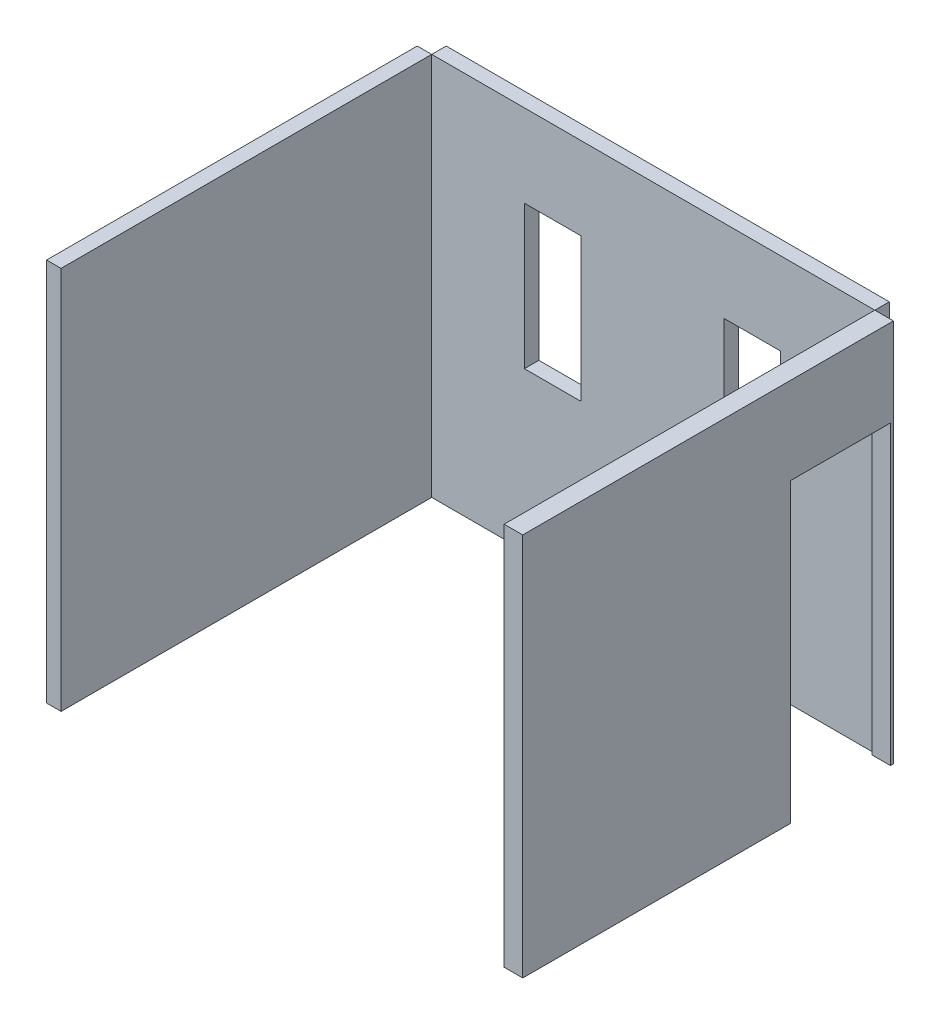
ISO-10303-21;
HEADER;
FILE_DESCRIPTION(('STEP AP214'),'2;1');
FILE_NAME('part.step','',(''),(''),'','','');
FILE_SCHEMA(('AUTOMOTIVE_DESIGN { 1 0 10303 214 1 1 1 1 }'));
ENDSEC;
DATA;
#1=APPLICATION_CONTEXT('core data for automotive mechanical design processes');
#2=APPLICATION_PROTOCOL_DEFINITION('international standard','automotive_design',2000,#1);
#3=PRODUCT_CONTEXT('',#1,'mechanical');
#4=PRODUCT('Part','Part','',(#3));
#5=PRODUCT_RELATED_PRODUCT_CATEGORY('part','',(#4));
#6=PRODUCT_DEFINITION_FORMATION('','',#4);
#7=PRODUCT_DEFINITION_CONTEXT('part definition',#1,'design');
#8=PRODUCT_DEFINITION('design','',#6,#7);
#9=PRODUCT_DEFINITION_SHAPE('','',#8);
#10=(LENGTH_UNIT() NAMED_UNIT(*) SI_UNIT(.MILLI.,.METRE.));
#11=(NAMED_UNIT(*) PLANE_ANGLE_UNIT() SI_UNIT($,.RADIAN.));
#12=(NAMED_UNIT(*) SI_UNIT($,.STERADIAN.) SOLID_ANGLE_UNIT());
#13=UNCERTAINTY_MEASURE_WITH_UNIT(LENGTH_MEASURE(1.E-05),#10,'distance_accuracy_value','');
#14=(GEOMETRIC_REPRESENTATION_CONTEXT(3) GLOBAL_UNCERTAINTY_ASSIGNED_CONTEXT((#13)) GLOBAL_UNIT_ASSIGNED_CONTEXT((#10,
#11,#12)) REPRESENTATION_CONTEXT('',''));
#15=CARTESIAN_POINT('',(0.,0.,0.));
#16=DIRECTION('',(0.,0.,1.));
#17=DIRECTION('',(1.,0.,0.));
#18=AXIS2_PLACEMENT_3D('',#15,#16,#17);
#19=CARTESIAN_POINT('',(3188.55153638041,0.,2660.));
#20=DIRECTION('',(0.,1.,0.));
#21=DIRECTION('',(0.,0.,1.));
#22=AXIS2_PLACEMENT_3D('',#19,#20,#21);
#23=PLANE('',#22);
#24=DIRECTION('',(0.,0.,-1.));
#25=VECTOR('',#24,1.);
#26=CARTESIAN_POINT('',(3060.,0.,2660.));
#27=LINE('',#26,#25);
#28=CARTESIAN_POINT('',(3060.,0.,2660.));
#29=VERTEX_POINT('',#28);
#30=CARTESIAN_POINT('',(3060.,0.,810.));
#31=VERTEX_POINT('',#30);
#32=EDGE_CURVE('E12',#29,#31,#27,.T.);
#33=ORIENTED_EDGE('',*,*,#32,.T.);
#34=DIRECTION('',(1.,0.,0.));
#35=VECTOR('',#34,1.);
#36=CARTESIAN_POINT('',(2138.55153638041,0.,810.));
#37=LINE('',#36,#35);
#38=CARTESIAN_POINT('',(3188.55153638041,0.,810.));
#39=VERTEX_POINT('',#38);
#40=EDGE_CURVE('E121',#31,#39,#37,.T.);
#41=ORIENTED_EDGE('',*,*,#40,.T.);
#42=DIRECTION('',(0.,0.,-1.));
#43=VECTOR('',#42,1.);
#44=CARTESIAN_POINT('',(3188.55153638041,0.,2660.));
#45=LINE('',#44,#43);
#46=CARTESIAN_POINT('',(3188.55153638041,0.,2660.));
#47=VERTEX_POINT('',#46);
#48=EDGE_CURVE('E131',#47,#39,#45,.T.);
#49=ORIENTED_EDGE('',*,*,#48,.F.);
#50=DIRECTION('',(1.,0.,0.));
#51=VECTOR('',#50,1.);
#52=CARTESIAN_POINT('',(3188.55153638041,0.,2660.));
#53=LINE('',#52,#51);
#54=EDGE_CURVE('E96',#29,#47,#53,.T.);
#55=ORIENTED_EDGE('',*,*,#54,.F.);
#56=EDGE_LOOP('',(#33,#41,#49,#55));
#57=FACE_BOUND('',#56,.T.);
#58=ADVANCED_FACE('F44',(#57),#23,.F.);
#59=CARTESIAN_POINT('',(3060.,2650.,2660.));
#60=DIRECTION('',(1.,0.,0.));
#61=DIRECTION('',(0.,0.,-1.));
#62=AXIS2_PLACEMENT_3D('',#59,#60,#61);
#63=PLANE('',#62);
#64=DIRECTION('',(0.,0.,1.));
#65=VECTOR('',#64,1.);
#66=CARTESIAN_POINT('',(3060.,2050.,2660.));
#67=LINE('',#66,#65);
#68=CARTESIAN_POINT('',(3060.,2050.,120.));
#69=VERTEX_POINT('',#68);
#70=CARTESIAN_POINT('',(3060.,2050.,810.));
#71=VERTEX_POINT('',#70);
#72=EDGE_CURVE('E161',#69,#71,#67,.T.);
#73=ORIENTED_EDGE('',*,*,#72,.T.);
#74=DIRECTION('',(0.,-1.,0.));
#75=VECTOR('',#74,1.);
#76=CARTESIAN_POINT('',(3060.,2650.,810.));
#77=LINE('',#76,#75);
#78=EDGE_CURVE('E155',#71,#31,#77,.T.);
#79=ORIENTED_EDGE('',*,*,#78,.T.);
#80=ORIENTED_EDGE('',*,*,#32,.F.);
#81=DIRECTION('',(0.,-1.,0.));
#82=VECTOR('',#81,1.);
#83=CARTESIAN_POINT('',(3060.,2650.,2660.));
#84=LINE('',#83,#82);
#85=CARTESIAN_POINT('',(3060.,2650.,2660.));
#86=VERTEX_POINT('',#85);
#87=EDGE_CURVE('E146',#86,#29,#84,.T.);
#88=ORIENTED_EDGE('',*,*,#87,.F.);
#89=DIRECTION('',(0.,0.,-1.));
#90=VECTOR('',#89,1.);
#91=CARTESIAN_POINT('',(3060.,2650.,2660.));
#92=LINE('',#91,#90);
#93=CARTESIAN_POINT('',(3060.,2650.,100.));
#94=VERTEX_POINT('',#93);
#95=EDGE_CURVE('E143',#86,#94,#92,.T.);
#96=ORIENTED_EDGE('',*,*,#95,.T.);
#97=DIRECTION('',(0.,-1.,0.));
#98=VECTOR('',#97,1.);
#99=CARTESIAN_POINT('',(3060.,2650.,100.));
#100=LINE('',#99,#98);
#101=CARTESIAN_POINT('',(3060.,0.,100.));
#102=VERTEX_POINT('',#101);
#103=EDGE_CURVE('E152',#94,#102,#100,.T.);
#104=ORIENTED_EDGE('',*,*,#103,.T.);
#105=CARTESIAN_POINT('',(3060.,0.,120.));
#106=VERTEX_POINT('',#105);
#107=EDGE_CURVE('E52',#106,#102,#27,.T.);
#108=ORIENTED_EDGE('',*,*,#107,.F.);
#109=DIRECTION('',(0.,1.,0.));
#110=VECTOR('',#109,1.);
#111=CARTESIAN_POINT('',(3060.,2650.,120.));
#112=LINE('',#111,#110);
#113=EDGE_CURVE('E164',#106,#69,#112,.T.);
#114=ORIENTED_EDGE('',*,*,#113,.T.);
#115=EDGE_LOOP('',(#73,#79,#80,#88,#96,#104,#108,#114));
#116=FACE_BOUND('',#115,.T.);
#117=ADVANCED_FACE('F46',(#116),#63,.F.);
#118=CARTESIAN_POINT('',(3188.55153638041,0.,120.));
#119=VERTEX_POINT('',#118);
#120=CARTESIAN_POINT('',(3188.55153638041,0.,100.));
#121=VERTEX_POINT('',#120);
#122=EDGE_CURVE('E139',#119,#121,#45,.T.);
#123=ORIENTED_EDGE('',*,*,#122,.F.);
#124=DIRECTION('',(1.,0.,0.));
#125=VECTOR('',#124,1.);
#126=CARTESIAN_POINT('',(2138.55153638041,0.,120.));
#127=LINE('',#126,#125);
#128=EDGE_CURVE('E59',#106,#119,#127,.T.);
#129=ORIENTED_EDGE('',*,*,#128,.F.);
#130=ORIENTED_EDGE('',*,*,#107,.T.);
#131=DIRECTION('',(1.,0.,0.));
#132=VECTOR('',#131,1.);
#133=CARTESIAN_POINT('',(3188.55153638041,0.,100.));
#134=LINE('',#133,#132);
#135=EDGE_CURVE('E149',#102,#121,#134,.T.);
#136=ORIENTED_EDGE('',*,*,#135,.T.);
#137=EDGE_LOOP('',(#123,#129,#130,#136));
#138=FACE_BOUND('',#137,.T.);
#139=ADVANCED_FACE('F180',(#138),#23,.F.);
#140=CARTESIAN_POINT('',(3188.55153638041,2650.,2660.));
#141=DIRECTION('',(-1.,0.,0.));
#142=DIRECTION('',(0.,0.,1.));
#143=AXIS2_PLACEMENT_3D('',#140,#141,#142);
#144=PLANE('',#143);
#145=ORIENTED_EDGE('',*,*,#48,.T.);
#146=DIRECTION('',(0.,-1.,0.));
#147=VECTOR('',#146,1.);
#148=CARTESIAN_POINT('',(3188.55153638041,2050.,810.));
#149=LINE('',#148,#147);
#150=CARTESIAN_POINT('',(3188.55153638041,2050.,810.));
#151=VERTEX_POINT('',#150);
#152=EDGE_CURVE('E118',#151,#39,#149,.T.);
#153=ORIENTED_EDGE('',*,*,#152,.F.);
#154=DIRECTION('',(0.,0.,1.));
#155=VECTOR('',#154,1.);
#156=CARTESIAN_POINT('',(3188.55153638041,2050.,810.));
#157=LINE('',#156,#155);
#158=CARTESIAN_POINT('',(3188.55153638041,2050.,120.));
#159=VERTEX_POINT('',#158);
#160=EDGE_CURVE('E134',#159,#151,#157,.T.);
#161=ORIENTED_EDGE('',*,*,#160,.F.);
#162=DIRECTION('',(0.,1.,0.));
#163=VECTOR('',#162,1.);
#164=CARTESIAN_POINT('',(3188.55153638041,0.,120.));
#165=LINE('',#164,#163);
#166=EDGE_CURVE('E129',#119,#159,#165,.T.);
#167=ORIENTED_EDGE('',*,*,#166,.F.);
#168=ORIENTED_EDGE('',*,*,#122,.T.);
#169=DIRECTION('',(0.,1.,0.));
#170=VECTOR('',#169,1.);
#171=CARTESIAN_POINT('',(3188.55153638041,2650.,100.));
#172=LINE('',#171,#170);
#173=CARTESIAN_POINT('',(3188.55153638041,2650.,100.));
#174=VERTEX_POINT('',#173);
#175=EDGE_CURVE('E147',#121,#174,#172,.T.);
#176=ORIENTED_EDGE('',*,*,#175,.T.);
#177=DIRECTION('',(0.,0.,-1.));
#178=VECTOR('',#177,1.);
#179=CARTESIAN_POINT('',(3188.55153638041,2650.,2660.));
#180=LINE('',#179,#178);
#181=CARTESIAN_POINT('',(3188.55153638041,2650.,2660.));
#182=VERTEX_POINT('',#181);
#183=EDGE_CURVE('E140',#182,#174,#180,.T.);
#184=ORIENTED_EDGE('',*,*,#183,.F.);
#185=DIRECTION('',(0.,1.,0.));
#186=VECTOR('',#185,1.);
#187=CARTESIAN_POINT('',(3188.55153638041,2650.,2660.));
#188=LINE('',#187,#186);
#189=EDGE_CURVE('E138',#47,#182,#188,.T.);
#190=ORIENTED_EDGE('',*,*,#189,.F.);
#191=EDGE_LOOP('',(#145,#153,#161,#167,#168,#176,#184,#190));
#192=FACE_BOUND('',#191,.T.);
#193=ADVANCED_FACE('F136',(#192),#144,.F.);
#194=CARTESIAN_POINT('',(3060.,2650.,2660.));
#195=DIRECTION('',(0.,-1.,0.));
#196=DIRECTION('',(0.,0.,-1.));
#197=AXIS2_PLACEMENT_3D('',#194,#195,#196);
#198=PLANE('',#197);
#199=DIRECTION('',(-1.,0.,0.));
#200=VECTOR('',#199,1.);
#201=CARTESIAN_POINT('',(3060.,2650.,100.));
#202=LINE('',#201,#200);
#203=EDGE_CURVE('E89',#174,#94,#202,.T.);
#204=ORIENTED_EDGE('',*,*,#203,.T.);
#205=ORIENTED_EDGE('',*,*,#95,.F.);
#206=DIRECTION('',(-1.,0.,0.));
#207=VECTOR('',#206,1.);
#208=CARTESIAN_POINT('',(3060.,2650.,2660.));
#209=LINE('',#208,#207);
#210=EDGE_CURVE('E68',#182,#86,#209,.T.);
#211=ORIENTED_EDGE('',*,*,#210,.F.);
#212=ORIENTED_EDGE('',*,*,#183,.T.);
#213=EDGE_LOOP('',(#204,#205,#211,#212));
#214=FACE_BOUND('',#213,.T.);
#215=ADVANCED_FACE('F184',(#214),#198,.F.);
#216=CARTESIAN_POINT('',(0.,0.,2660.));
#217=DIRECTION('',(0.,0.,-1.));
#218=DIRECTION('',(-1.,0.,0.));
#219=AXIS2_PLACEMENT_3D('',#216,#217,#218);
#220=PLANE('',#219);
#221=ORIENTED_EDGE('',*,*,#87,.T.);
#222=ORIENTED_EDGE('',*,*,#54,.T.);
#223=ORIENTED_EDGE('',*,*,#189,.T.);
#224=ORIENTED_EDGE('',*,*,#210,.T.);
#225=EDGE_LOOP('',(#221,#222,#223,#224));
#226=FACE_BOUND('',#225,.T.);
#227=ADVANCED_FACE('F188',(#226),#220,.F.);
#228=CARTESIAN_POINT('',(0.,0.,100.));
#229=DIRECTION('',(0.,0.,-1.));
#230=DIRECTION('',(-1.,0.,0.));
#231=AXIS2_PLACEMENT_3D('',#228,#229,#230);
#232=PLANE('',#231);
#233=ORIENTED_EDGE('',*,*,#103,.F.);
#234=ORIENTED_EDGE('',*,*,#203,.F.);
#235=ORIENTED_EDGE('',*,*,#175,.F.);
#236=ORIENTED_EDGE('',*,*,#135,.F.);
#237=EDGE_LOOP('',(#233,#234,#235,#236));
#238=FACE_BOUND('',#237,.T.);
#239=ADVANCED_FACE('F186',(#238),#232,.T.);
#240=CARTESIAN_POINT('',(2138.55153638041,2050.,810.));
#241=DIRECTION('',(0.,0.,1.));
#242=DIRECTION('',(0.,-1.,0.));
#243=AXIS2_PLACEMENT_3D('',#240,#241,#242);
#244=PLANE('',#243);
#245=DIRECTION('',(1.,0.,0.));
#246=VECTOR('',#245,1.);
#247=CARTESIAN_POINT('',(2138.55153638041,2050.,810.));
#248=LINE('',#247,#246);
#249=EDGE_CURVE('E124',#71,#151,#248,.T.);
#250=ORIENTED_EDGE('',*,*,#249,.T.);
#251=ORIENTED_EDGE('',*,*,#152,.T.);
#252=ORIENTED_EDGE('',*,*,#40,.F.);
#253=ORIENTED_EDGE('',*,*,#78,.F.);
#254=EDGE_LOOP('',(#250,#251,#252,#253));
#255=FACE_BOUND('',#254,.T.);
#256=ADVANCED_FACE('F120',(#255),#244,.F.);
#257=CARTESIAN_POINT('',(2138.55153638041,2050.,810.));
#258=DIRECTION('',(0.,1.,0.));
#259=DIRECTION('',(0.,0.,1.));
#260=AXIS2_PLACEMENT_3D('',#257,#258,#259);
#261=PLANE('',#260);
#262=DIRECTION('',(1.,0.,0.));
#263=VECTOR('',#262,1.);
#264=CARTESIAN_POINT('',(2138.55153638041,2050.,120.));
#265=LINE('',#264,#263);
#266=EDGE_CURVE('E168',#69,#159,#265,.T.);
#267=ORIENTED_EDGE('',*,*,#266,.T.);
#268=ORIENTED_EDGE('',*,*,#160,.T.);
#269=ORIENTED_EDGE('',*,*,#249,.F.);
#270=ORIENTED_EDGE('',*,*,#72,.F.);
#271=EDGE_LOOP('',(#267,#268,#269,#270));
#272=FACE_BOUND('',#271,.T.);
#273=ADVANCED_FACE('F176',(#272),#261,.F.);
#274=CARTESIAN_POINT('',(2138.55153638041,0.,120.));
#275=DIRECTION('',(0.,0.,-1.));
#276=DIRECTION('',(-1.,0.,0.));
#277=AXIS2_PLACEMENT_3D('',#274,#275,#276);
#278=PLANE('',#277);
#279=ORIENTED_EDGE('',*,*,#128,.T.);
#280=ORIENTED_EDGE('',*,*,#166,.T.);
#281=ORIENTED_EDGE('',*,*,#266,.F.);
#282=ORIENTED_EDGE('',*,*,#113,.F.);
#283=EDGE_LOOP('',(#279,#280,#281,#282));
#284=FACE_BOUND('',#283,.T.);
#285=ADVANCED_FACE('F173',(#284),#278,.F.);
#286=CLOSED_SHELL('',(#58,#117,#139,#193,#215,#227,#239,#256,#273,#285));
#287=MANIFOLD_SOLID_BREP('B2',#286);
#288=CARTESIAN_POINT('',(0.,2650.,2660.));
#289=DIRECTION('',(-1.,0.,0.));
#290=DIRECTION('',(0.,0.,1.));
#291=AXIS2_PLACEMENT_3D('',#288,#289,#290);
#292=PLANE('',#291);
#293=DIRECTION('',(0.,1.,0.));
#294=VECTOR('',#293,1.);
#295=CARTESIAN_POINT('',(0.,2650.,100.));
#296=LINE('',#295,#294);
#297=CARTESIAN_POINT('',(0.,0.,100.));
#298=VERTEX_POINT('',#297);
#299=CARTESIAN_POINT('',(0.,2650.,100.));
#300=VERTEX_POINT('',#299);
#301=EDGE_CURVE('E341',#298,#300,#296,.T.);
#302=ORIENTED_EDGE('',*,*,#301,.T.);
#303=DIRECTION('',(0.,0.,-1.));
#304=VECTOR('',#303,1.);
#305=CARTESIAN_POINT('',(0.,2650.,2660.));
#306=LINE('',#305,#304);
#307=CARTESIAN_POINT('',(0.,2650.,2660.));
#308=VERTEX_POINT('',#307);
#309=EDGE_CURVE('E42',#308,#300,#306,.T.);
#310=ORIENTED_EDGE('',*,*,#309,.F.);
#311=DIRECTION('',(0.,1.,0.));
#312=VECTOR('',#311,1.);
#313=CARTESIAN_POINT('',(0.,2650.,2660.));
#314=LINE('',#313,#312);
#315=CARTESIAN_POINT('',(0.,0.,2660.));
#316=VERTEX_POINT('',#315);
#317=EDGE_CURVE('E329',#316,#308,#314,.T.);
#318=ORIENTED_EDGE('',*,*,#317,.F.);
#319=DIRECTION('',(0.,0.,-1.));
#320=VECTOR('',#319,1.);
#321=CARTESIAN_POINT('',(0.,0.,2660.));
#322=LINE('',#321,#320);
#323=EDGE_CURVE('E337',#316,#298,#322,.T.);
#324=ORIENTED_EDGE('',*,*,#323,.T.);
#325=EDGE_LOOP('',(#302,#310,#318,#324));
#326=FACE_BOUND('',#325,.T.);
#327=ADVANCED_FACE('F278',(#326),#292,.F.);
#328=CARTESIAN_POINT('',(0.,2650.,2660.));
#329=DIRECTION('',(0.,-1.,0.));
#330=DIRECTION('',(0.,0.,-1.));
#331=AXIS2_PLACEMENT_3D('',#328,#329,#330);
#332=PLANE('',#331);
#333=DIRECTION('',(-1.,0.,0.));
#334=VECTOR('',#333,1.);
#335=CARTESIAN_POINT('',(0.,2650.,100.));
#336=LINE('',#335,#334);
#337=CARTESIAN_POINT('',(-100.,2650.,100.));
#338=VERTEX_POINT('',#337);
#339=EDGE_CURVE('E333',#300,#338,#336,.T.);
#340=ORIENTED_EDGE('',*,*,#339,.T.);
#341=DIRECTION('',(0.,0.,-1.));
#342=VECTOR('',#341,1.);
#343=CARTESIAN_POINT('',(-100.,2650.,2660.));
#344=LINE('',#343,#342);
#345=CARTESIAN_POINT('',(-100.,2650.,2660.));
#346=VERTEX_POINT('',#345);
#347=EDGE_CURVE('E286',#346,#338,#344,.T.);
#348=ORIENTED_EDGE('',*,*,#347,.F.);
#349=DIRECTION('',(-1.,0.,0.));
#350=VECTOR('',#349,1.);
#351=CARTESIAN_POINT('',(0.,2650.,2660.));
#352=LINE('',#351,#350);
#353=EDGE_CURVE('E324',#308,#346,#352,.T.);
#354=ORIENTED_EDGE('',*,*,#353,.F.);
#355=ORIENTED_EDGE('',*,*,#309,.T.);
#356=EDGE_LOOP('',(#340,#348,#354,#355));
#357=FACE_BOUND('',#356,.T.);
#358=ADVANCED_FACE('F332',(#357),#332,.F.);
#359=CARTESIAN_POINT('',(-100.,2650.,2660.));
#360=DIRECTION('',(1.,0.,0.));
#361=DIRECTION('',(0.,1.,0.));
#362=AXIS2_PLACEMENT_3D('',#359,#360,#361);
#363=PLANE('',#362);
#364=DIRECTION('',(0.,-1.,0.));
#365=VECTOR('',#364,1.);
#366=CARTESIAN_POINT('',(-100.,2650.,100.));
#367=LINE('',#366,#365);
#368=CARTESIAN_POINT('',(-99.9999999999997,0.,100.));
#369=VERTEX_POINT('',#368);
#370=EDGE_CURVE('E311',#338,#369,#367,.T.);
#371=ORIENTED_EDGE('',*,*,#370,.T.);
#372=DIRECTION('',(0.,0.,-1.));
#373=VECTOR('',#372,1.);
#374=CARTESIAN_POINT('',(-99.9999999999997,0.,2660.));
#375=LINE('',#374,#373);
#376=CARTESIAN_POINT('',(-99.9999999999997,0.,2660.));
#377=VERTEX_POINT('',#376);
#378=EDGE_CURVE('E334',#377,#369,#375,.T.);
#379=ORIENTED_EDGE('',*,*,#378,.F.);
#380=DIRECTION('',(0.,-1.,0.));
#381=VECTOR('',#380,1.);
#382=CARTESIAN_POINT('',(-100.,2650.,2660.));
#383=LINE('',#382,#381);
#384=EDGE_CURVE('E327',#346,#377,#383,.T.);
#385=ORIENTED_EDGE('',*,*,#384,.F.);
#386=ORIENTED_EDGE('',*,*,#347,.T.);
#387=EDGE_LOOP('',(#371,#379,#385,#386));
#388=FACE_BOUND('',#387,.T.);
#389=ADVANCED_FACE('F335',(#388),#363,.F.);
#390=CARTESIAN_POINT('',(0.,0.,2660.));
#391=DIRECTION('',(0.,1.,0.));
#392=DIRECTION('',(-1.,0.,0.));
#393=AXIS2_PLACEMENT_3D('',#390,#391,#392);
#394=PLANE('',#393);
#395=DIRECTION('',(1.,0.,0.));
#396=VECTOR('',#395,1.);
#397=CARTESIAN_POINT('',(0.,0.,100.));
#398=LINE('',#397,#396);
#399=EDGE_CURVE('E317',#369,#298,#398,.T.);
#400=ORIENTED_EDGE('',*,*,#399,.T.);
#401=ORIENTED_EDGE('',*,*,#323,.F.);
#402=DIRECTION('',(1.,0.,0.));
#403=VECTOR('',#402,1.);
#404=CARTESIAN_POINT('',(0.,0.,2660.));
#405=LINE('',#404,#403);
#406=EDGE_CURVE('E294',#377,#316,#405,.T.);
#407=ORIENTED_EDGE('',*,*,#406,.F.);
#408=ORIENTED_EDGE('',*,*,#378,.T.);
#409=EDGE_LOOP('',(#400,#401,#407,#408));
#410=FACE_BOUND('',#409,.T.);
#411=ADVANCED_FACE('F348',(#410),#394,.F.);
#412=CARTESIAN_POINT('',(0.,0.,2660.));
#413=DIRECTION('',(0.,0.,-1.));
#414=DIRECTION('',(-1.,0.,0.));
#415=AXIS2_PLACEMENT_3D('',#412,#413,#414);
#416=PLANE('',#415);
#417=ORIENTED_EDGE('',*,*,#317,.T.);
#418=ORIENTED_EDGE('',*,*,#353,.T.);
#419=ORIENTED_EDGE('',*,*,#384,.T.);
#420=ORIENTED_EDGE('',*,*,#406,.T.);
#421=EDGE_LOOP('',(#417,#418,#419,#420));
#422=FACE_BOUND('',#421,.T.);
#423=ADVANCED_FACE('F325',(#422),#416,.F.);
#424=CARTESIAN_POINT('',(0.,0.,100.));
#425=DIRECTION('',(0.,0.,-1.));
#426=DIRECTION('',(-1.,0.,0.));
#427=AXIS2_PLACEMENT_3D('',#424,#425,#426);
#428=PLANE('',#427);
#429=ORIENTED_EDGE('',*,*,#301,.F.);
#430=ORIENTED_EDGE('',*,*,#399,.F.);
#431=ORIENTED_EDGE('',*,*,#370,.F.);
#432=ORIENTED_EDGE('',*,*,#339,.F.);
#433=EDGE_LOOP('',(#429,#430,#431,#432));
#434=FACE_BOUND('',#433,.T.);
#435=ADVANCED_FACE('F351',(#434),#428,.T.);
#436=CLOSED_SHELL('',(#327,#358,#389,#411,#423,#435));
#437=MANIFOLD_SOLID_BREP('B6',#436);
#438=CARTESIAN_POINT('',(0.,0.,100.));
#439=DIRECTION('',(1.,0.,0.));
#440=DIRECTION('',(0.,0.,-1.));
#441=AXIS2_PLACEMENT_3D('',#438,#439,#440);
#442=PLANE('',#441);
#443=DIRECTION('',(0.,-1.,0.));
#444=VECTOR('',#443,1.);
#445=CARTESIAN_POINT('',(0.,0.,0.));
#446=LINE('',#445,#444);
#447=CARTESIAN_POINT('',(0.,2650.,0.));
#448=VERTEX_POINT('',#447);
#449=CARTESIAN_POINT('',(0.,0.,0.));
#450=VERTEX_POINT('',#449);
#451=EDGE_CURVE('E531',#448,#450,#446,.T.);
#452=ORIENTED_EDGE('',*,*,#451,.T.);
#453=DIRECTION('',(0.,0.,-1.));
#454=VECTOR('',#453,1.);
#455=CARTESIAN_POINT('',(0.,0.,100.));
#456=LINE('',#455,#454);
#457=CARTESIAN_POINT('',(0.,0.,100.));
#458=VERTEX_POINT('',#457);
#459=EDGE_CURVE('E564',#458,#450,#456,.T.);
#460=ORIENTED_EDGE('',*,*,#459,.F.);
#461=DIRECTION('',(0.,-1.,0.));
#462=VECTOR('',#461,1.);
#463=CARTESIAN_POINT('',(0.,0.,100.));
#464=LINE('',#463,#462);
#465=CARTESIAN_POINT('',(0.,2650.,100.));
#466=VERTEX_POINT('',#465);
#467=EDGE_CURVE('E538',#466,#458,#464,.T.);
#468=ORIENTED_EDGE('',*,*,#467,.F.);
#469=DIRECTION('',(0.,0.,-1.));
#470=VECTOR('',#469,1.);
#471=CARTESIAN_POINT('',(0.,2650.,100.));
#472=LINE('',#471,#470);
#473=EDGE_CURVE('E548',#466,#448,#472,.T.);
#474=ORIENTED_EDGE('',*,*,#473,.T.);
#475=EDGE_LOOP('',(#452,#460,#468,#474));
#476=FACE_BOUND('',#475,.T.);
#477=ADVANCED_FACE('F402',(#476),#442,.F.);
#478=CARTESIAN_POINT('',(0.,0.,100.));
#479=DIRECTION('',(0.,1.,0.));
#480=DIRECTION('',(0.,0.,1.));
#481=AXIS2_PLACEMENT_3D('',#478,#479,#480);
#482=PLANE('',#481);
#483=DIRECTION('',(1.,0.,0.));
#484=VECTOR('',#483,1.);
#485=CARTESIAN_POINT('',(0.,0.,0.));
#486=LINE('',#485,#484);
#487=CARTESIAN_POINT('',(3060.,0.,0.));
#488=VERTEX_POINT('',#487);
#489=EDGE_CURVE('E551',#450,#488,#486,.T.);
#490=ORIENTED_EDGE('',*,*,#489,.T.);
#491=DIRECTION('',(0.,0.,-1.));
#492=VECTOR('',#491,1.);
#493=CARTESIAN_POINT('',(3060.,0.,100.));
#494=LINE('',#493,#492);
#495=CARTESIAN_POINT('',(3060.,0.,100.));
#496=VERTEX_POINT('',#495);
#497=EDGE_CURVE('E561',#496,#488,#494,.T.);
#498=ORIENTED_EDGE('',*,*,#497,.F.);
#499=DIRECTION('',(1.,0.,0.));
#500=VECTOR('',#499,1.);
#501=CARTESIAN_POINT('',(0.,0.,100.));
#502=LINE('',#501,#500);
#503=EDGE_CURVE('E541',#458,#496,#502,.T.);
#504=ORIENTED_EDGE('',*,*,#503,.F.);
#505=ORIENTED_EDGE('',*,*,#459,.T.);
#506=EDGE_LOOP('',(#490,#498,#504,#505));
#507=FACE_BOUND('',#506,.T.);
#508=ADVANCED_FACE('F601',(#507),#482,.F.);
#509=CARTESIAN_POINT('',(3060.,0.,100.));
#510=DIRECTION('',(-1.,0.,0.));
#511=DIRECTION('',(0.,0.,1.));
#512=AXIS2_PLACEMENT_3D('',#509,#510,#511);
#513=PLANE('',#512);
#514=DIRECTION('',(0.,1.,0.));
#515=VECTOR('',#514,1.);
#516=CARTESIAN_POINT('',(3060.,0.,0.));
#517=LINE('',#516,#515);
#518=CARTESIAN_POINT('',(3060.,2650.,0.));
#519=VERTEX_POINT('',#518);
#520=EDGE_CURVE('E553',#488,#519,#517,.T.);
#521=ORIENTED_EDGE('',*,*,#520,.T.);
#522=DIRECTION('',(0.,0.,-1.));
#523=VECTOR('',#522,1.);
#524=CARTESIAN_POINT('',(3060.,2650.,100.));
#525=LINE('',#524,#523);
#526=CARTESIAN_POINT('',(3060.,2650.,100.));
#527=VERTEX_POINT('',#526);
#528=EDGE_CURVE('E558',#527,#519,#525,.T.);
#529=ORIENTED_EDGE('',*,*,#528,.F.);
#530=DIRECTION('',(0.,1.,0.));
#531=VECTOR('',#530,1.);
#532=CARTESIAN_POINT('',(3060.,0.,100.));
#533=LINE('',#532,#531);
#534=EDGE_CURVE('E544',#496,#527,#533,.T.);
#535=ORIENTED_EDGE('',*,*,#534,.F.);
#536=ORIENTED_EDGE('',*,*,#497,.T.);
#537=EDGE_LOOP('',(#521,#529,#535,#536));
#538=FACE_BOUND('',#537,.T.);
#539=ADVANCED_FACE('F606',(#538),#513,.F.);
#540=CARTESIAN_POINT('',(0.,2650.,100.));
#541=DIRECTION('',(0.,-1.,0.));
#542=DIRECTION('',(0.,0.,-1.));
#543=AXIS2_PLACEMENT_3D('',#540,#541,#542);
#544=PLANE('',#543);
#545=DIRECTION('',(-1.,0.,0.));
#546=VECTOR('',#545,1.);
#547=CARTESIAN_POINT('',(0.,2650.,0.));
#548=LINE('',#547,#546);
#549=EDGE_CURVE('E542',#519,#448,#548,.T.);
#550=ORIENTED_EDGE('',*,*,#549,.T.);
#551=ORIENTED_EDGE('',*,*,#473,.F.);
#552=DIRECTION('',(-1.,0.,0.));
#553=VECTOR('',#552,1.);
#554=CARTESIAN_POINT('',(0.,2650.,100.));
#555=LINE('',#554,#553);
#556=EDGE_CURVE('E546',#527,#466,#555,.T.);
#557=ORIENTED_EDGE('',*,*,#556,.F.);
#558=ORIENTED_EDGE('',*,*,#528,.T.);
#559=EDGE_LOOP('',(#550,#551,#557,#558));
#560=FACE_BOUND('',#559,.T.);
#561=ADVANCED_FACE('F621',(#560),#544,.F.);
#562=CARTESIAN_POINT('',(0.,0.,100.));
#563=DIRECTION('',(0.,0.,-1.));
#564=DIRECTION('',(-1.,0.,0.));
#565=AXIS2_PLACEMENT_3D('',#562,#563,#564);
#566=PLANE('',#565);
#567=DIRECTION('',(0.,-1.,0.));
#568=VECTOR('',#567,1.);
#569=CARTESIAN_POINT('',(640.,2080.,100.));
#570=LINE('',#569,#568);
#571=CARTESIAN_POINT('',(640.,2080.,100.));
#572=VERTEX_POINT('',#571);
#573=CARTESIAN_POINT('',(640.,1090.,100.));
#574=VERTEX_POINT('',#573);
#575=EDGE_CURVE('E501',#572,#574,#570,.T.);
#576=ORIENTED_EDGE('',*,*,#575,.F.);
#577=DIRECTION('',(-1.,0.,0.));
#578=VECTOR('',#577,1.);
#579=CARTESIAN_POINT('',(640.,2080.,100.));
#580=LINE('',#579,#578);
#581=CARTESIAN_POINT('',(1030.,2080.,100.));
#582=VERTEX_POINT('',#581);
#583=EDGE_CURVE('E416',#582,#572,#580,.T.);
#584=ORIENTED_EDGE('',*,*,#583,.F.);
#585=DIRECTION('',(0.,1.,0.));
#586=VECTOR('',#585,1.);
#587=CARTESIAN_POINT('',(1030.,2080.,100.));
#588=LINE('',#587,#586);
#589=CARTESIAN_POINT('',(1030.,1090.,100.));
#590=VERTEX_POINT('',#589);
#591=EDGE_CURVE('E508',#590,#582,#588,.T.);
#592=ORIENTED_EDGE('',*,*,#591,.F.);
#593=DIRECTION('',(1.,0.,0.));
#594=VECTOR('',#593,1.);
#595=CARTESIAN_POINT('',(1030.,1090.,100.));
#596=LINE('',#595,#594);
#597=EDGE_CURVE('E492',#574,#590,#596,.T.);
#598=ORIENTED_EDGE('',*,*,#597,.F.);
#599=EDGE_LOOP('',(#576,#584,#592,#598));
#600=FACE_BOUND('',#599,.T.);
#601=DIRECTION('',(0.,1.,0.));
#602=VECTOR('',#601,1.);
#603=CARTESIAN_POINT('',(2410.,1090.,100.));
#604=LINE('',#603,#602);
#605=CARTESIAN_POINT('',(2410.,1090.,100.));
#606=VERTEX_POINT('',#605);
#607=CARTESIAN_POINT('',(2410.,2080.,100.));
#608=VERTEX_POINT('',#607);
#609=EDGE_CURVE('E519',#606,#608,#604,.T.);
#610=ORIENTED_EDGE('',*,*,#609,.F.);
#611=DIRECTION('',(1.,0.,0.));
#612=VECTOR('',#611,1.);
#613=CARTESIAN_POINT('',(2020.,1090.,100.));
#614=LINE('',#613,#612);
#615=CARTESIAN_POINT('',(2020.,1090.,100.));
#616=VERTEX_POINT('',#615);
#617=EDGE_CURVE('E515',#616,#606,#614,.T.);
#618=ORIENTED_EDGE('',*,*,#617,.F.);
#619=DIRECTION('',(0.,-1.,0.));
#620=VECTOR('',#619,1.);
#621=CARTESIAN_POINT('',(2020.,2080.,100.));
#622=LINE('',#621,#620);
#623=CARTESIAN_POINT('',(2020.,2080.,100.));
#624=VERTEX_POINT('',#623);
#625=EDGE_CURVE('E525',#624,#616,#622,.T.);
#626=ORIENTED_EDGE('',*,*,#625,.F.);
#627=DIRECTION('',(-1.,0.,0.));
#628=VECTOR('',#627,1.);
#629=CARTESIAN_POINT('',(2410.,2080.,100.));
#630=LINE('',#629,#628);
#631=EDGE_CURVE('E522',#608,#624,#630,.T.);
#632=ORIENTED_EDGE('',*,*,#631,.F.);
#633=EDGE_LOOP('',(#610,#618,#626,#632));
#634=FACE_BOUND('',#633,.T.);
#635=ORIENTED_EDGE('',*,*,#467,.T.);
#636=ORIENTED_EDGE('',*,*,#503,.T.);
#637=ORIENTED_EDGE('',*,*,#534,.T.);
#638=ORIENTED_EDGE('',*,*,#556,.T.);
#639=EDGE_LOOP('',(#635,#636,#637,#638));
#640=FACE_BOUND('',#639,.T.);
#641=ADVANCED_FACE('F505',(#600,#634,#640),#566,.F.);
#642=CARTESIAN_POINT('',(0.,0.,0.));
#643=DIRECTION('',(0.,0.,-1.));
#644=DIRECTION('',(-1.,0.,0.));
#645=AXIS2_PLACEMENT_3D('',#642,#643,#644);
#646=PLANE('',#645);
#647=DIRECTION('',(1.,0.,0.));
#648=VECTOR('',#647,1.);
#649=CARTESIAN_POINT('',(0.,2080.,0.));
#650=LINE('',#649,#648);
#651=CARTESIAN_POINT('',(640.,2080.,0.));
#652=VERTEX_POINT('',#651);
#653=CARTESIAN_POINT('',(1030.,2080.,0.));
#654=VERTEX_POINT('',#653);
#655=EDGE_CURVE('E276',#652,#654,#650,.T.);
#656=ORIENTED_EDGE('',*,*,#655,.F.);
#657=DIRECTION('',(0.,1.,0.));
#658=VECTOR('',#657,1.);
#659=CARTESIAN_POINT('',(640.,0.,0.));
#660=LINE('',#659,#658);
#661=CARTESIAN_POINT('',(640.,1090.,0.));
#662=VERTEX_POINT('',#661);
#663=EDGE_CURVE('E576',#662,#652,#660,.T.);
#664=ORIENTED_EDGE('',*,*,#663,.F.);
#665=DIRECTION('',(-1.,0.,0.));
#666=VECTOR('',#665,1.);
#667=CARTESIAN_POINT('',(0.,1090.,0.));
#668=LINE('',#667,#666);
#669=CARTESIAN_POINT('',(1030.,1090.,0.));
#670=VERTEX_POINT('',#669);
#671=EDGE_CURVE('E495',#670,#662,#668,.T.);
#672=ORIENTED_EDGE('',*,*,#671,.F.);
#673=DIRECTION('',(0.,-1.,0.));
#674=VECTOR('',#673,1.);
#675=CARTESIAN_POINT('',(1030.,0.,0.));
#676=LINE('',#675,#674);
#677=EDGE_CURVE('E409',#654,#670,#676,.T.);
#678=ORIENTED_EDGE('',*,*,#677,.F.);
#679=EDGE_LOOP('',(#656,#664,#672,#678));
#680=FACE_BOUND('',#679,.T.);
#681=DIRECTION('',(-1.,0.,0.));
#682=VECTOR('',#681,1.);
#683=CARTESIAN_POINT('',(0.,1090.,0.));
#684=LINE('',#683,#682);
#685=CARTESIAN_POINT('',(2410.,1090.,0.));
#686=VERTEX_POINT('',#685);
#687=CARTESIAN_POINT('',(2020.,1090.,0.));
#688=VERTEX_POINT('',#687);
#689=EDGE_CURVE('E574',#686,#688,#684,.T.);
#690=ORIENTED_EDGE('',*,*,#689,.F.);
#691=DIRECTION('',(0.,-1.,0.));
#692=VECTOR('',#691,1.);
#693=CARTESIAN_POINT('',(2410.,0.,0.));
#694=LINE('',#693,#692);
#695=CARTESIAN_POINT('',(2410.,2080.,0.));
#696=VERTEX_POINT('',#695);
#697=EDGE_CURVE('E567',#696,#686,#694,.T.);
#698=ORIENTED_EDGE('',*,*,#697,.F.);
#699=DIRECTION('',(1.,0.,0.));
#700=VECTOR('',#699,1.);
#701=CARTESIAN_POINT('',(0.,2080.,0.));
#702=LINE('',#701,#700);
#703=CARTESIAN_POINT('',(2020.,2080.,0.));
#704=VERTEX_POINT('',#703);
#705=EDGE_CURVE('E569',#704,#696,#702,.T.);
#706=ORIENTED_EDGE('',*,*,#705,.F.);
#707=DIRECTION('',(0.,1.,0.));
#708=VECTOR('',#707,1.);
#709=CARTESIAN_POINT('',(2020.,0.,0.));
#710=LINE('',#709,#708);
#711=EDGE_CURVE('E572',#688,#704,#710,.T.);
#712=ORIENTED_EDGE('',*,*,#711,.F.);
#713=EDGE_LOOP('',(#690,#698,#706,#712));
#714=FACE_BOUND('',#713,.T.);
#715=ORIENTED_EDGE('',*,*,#451,.F.);
#716=ORIENTED_EDGE('',*,*,#549,.F.);
#717=ORIENTED_EDGE('',*,*,#520,.F.);
#718=ORIENTED_EDGE('',*,*,#489,.F.);
#719=EDGE_LOOP('',(#715,#716,#717,#718));
#720=FACE_BOUND('',#719,.T.);
#721=ADVANCED_FACE('F584',(#680,#714,#720),#646,.T.);
#722=CARTESIAN_POINT('',(2020.,1090.,-649.));
#723=DIRECTION('',(0.,-1.,0.));
#724=DIRECTION('',(0.,0.,-1.));
#725=AXIS2_PLACEMENT_3D('',#722,#723,#724);
#726=PLANE('',#725);
#727=ORIENTED_EDGE('',*,*,#689,.T.);
#728=DIRECTION('',(0.,0.,1.));
#729=VECTOR('',#728,1.);
#730=CARTESIAN_POINT('',(2020.,1090.,-649.));
#731=LINE('',#730,#729);
#732=EDGE_CURVE('E529',#688,#616,#731,.T.);
#733=ORIENTED_EDGE('',*,*,#732,.T.);
#734=ORIENTED_EDGE('',*,*,#617,.T.);
#735=DIRECTION('',(0.,0.,1.));
#736=VECTOR('',#735,1.);
#737=CARTESIAN_POINT('',(2410.,1090.,-649.));
#738=LINE('',#737,#736);
#739=EDGE_CURVE('E528',#686,#606,#738,.T.);
#740=ORIENTED_EDGE('',*,*,#739,.F.);
#741=EDGE_LOOP('',(#727,#733,#734,#740));
#742=FACE_BOUND('',#741,.T.);
#743=ADVANCED_FACE('F632',(#742),#726,.F.);
#744=CARTESIAN_POINT('',(2020.,2080.,-649.));
#745=DIRECTION('',(-1.,0.,0.));
#746=DIRECTION('',(0.,0.,1.));
#747=AXIS2_PLACEMENT_3D('',#744,#745,#746);
#748=PLANE('',#747);
#749=ORIENTED_EDGE('',*,*,#711,.T.);
#750=DIRECTION('',(0.,0.,1.));
#751=VECTOR('',#750,1.);
#752=CARTESIAN_POINT('',(2020.,2080.,-649.));
#753=LINE('',#752,#751);
#754=EDGE_CURVE('E532',#704,#624,#753,.T.);
#755=ORIENTED_EDGE('',*,*,#754,.T.);
#756=ORIENTED_EDGE('',*,*,#625,.T.);
#757=ORIENTED_EDGE('',*,*,#732,.F.);
#758=EDGE_LOOP('',(#749,#755,#756,#757));
#759=FACE_BOUND('',#758,.T.);
#760=ADVANCED_FACE('F636',(#759),#748,.F.);
#761=CARTESIAN_POINT('',(2410.,2080.,-649.));
#762=DIRECTION('',(0.,1.,0.));
#763=DIRECTION('',(0.,0.,1.));
#764=AXIS2_PLACEMENT_3D('',#761,#762,#763);
#765=PLANE('',#764);
#766=ORIENTED_EDGE('',*,*,#705,.T.);
#767=DIRECTION('',(0.,0.,1.));
#768=VECTOR('',#767,1.);
#769=CARTESIAN_POINT('',(2410.,2080.,-649.));
#770=LINE('',#769,#768);
#771=EDGE_CURVE('E534',#696,#608,#770,.T.);
#772=ORIENTED_EDGE('',*,*,#771,.T.);
#773=ORIENTED_EDGE('',*,*,#631,.T.);
#774=ORIENTED_EDGE('',*,*,#754,.F.);
#775=EDGE_LOOP('',(#766,#772,#773,#774));
#776=FACE_BOUND('',#775,.T.);
#777=ADVANCED_FACE('F595',(#776),#765,.F.);
#778=CARTESIAN_POINT('',(2410.,1090.,-649.));
#779=DIRECTION('',(1.,0.,0.));
#780=DIRECTION('',(0.,0.,-1.));
#781=AXIS2_PLACEMENT_3D('',#778,#779,#780);
#782=PLANE('',#781);
#783=ORIENTED_EDGE('',*,*,#697,.T.);
#784=ORIENTED_EDGE('',*,*,#739,.T.);
#785=ORIENTED_EDGE('',*,*,#609,.T.);
#786=ORIENTED_EDGE('',*,*,#771,.F.);
#787=EDGE_LOOP('',(#783,#784,#785,#786));
#788=FACE_BOUND('',#787,.T.);
#789=ADVANCED_FACE('F588',(#788),#782,.F.);
#790=CARTESIAN_POINT('',(640.,2080.,-649.));
#791=DIRECTION('',(0.,1.,0.));
#792=DIRECTION('',(0.,0.,1.));
#793=AXIS2_PLACEMENT_3D('',#790,#791,#792);
#794=PLANE('',#793);
#795=ORIENTED_EDGE('',*,*,#655,.T.);
#796=DIRECTION('',(0.,0.,1.));
#797=VECTOR('',#796,1.);
#798=CARTESIAN_POINT('',(1030.,2080.,-649.));
#799=LINE('',#798,#797);
#800=EDGE_CURVE('E513',#654,#582,#799,.T.);
#801=ORIENTED_EDGE('',*,*,#800,.T.);
#802=ORIENTED_EDGE('',*,*,#583,.T.);
#803=DIRECTION('',(0.,0.,1.));
#804=VECTOR('',#803,1.);
#805=CARTESIAN_POINT('',(640.,2080.,-649.));
#806=LINE('',#805,#804);
#807=EDGE_CURVE('E498',#652,#572,#806,.T.);
#808=ORIENTED_EDGE('',*,*,#807,.F.);
#809=EDGE_LOOP('',(#795,#801,#802,#808));
#810=FACE_BOUND('',#809,.T.);
#811=ADVANCED_FACE('F586',(#810),#794,.F.);
#812=CARTESIAN_POINT('',(1030.,2080.,-649.));
#813=DIRECTION('',(1.,0.,0.));
#814=DIRECTION('',(0.,0.,-1.));
#815=AXIS2_PLACEMENT_3D('',#812,#813,#814);
#816=PLANE('',#815);
#817=ORIENTED_EDGE('',*,*,#677,.T.);
#818=DIRECTION('',(0.,0.,1.));
#819=VECTOR('',#818,1.);
#820=CARTESIAN_POINT('',(1030.,1090.,-649.));
#821=LINE('',#820,#819);
#822=EDGE_CURVE('E497',#670,#590,#821,.T.);
#823=ORIENTED_EDGE('',*,*,#822,.T.);
#824=ORIENTED_EDGE('',*,*,#591,.T.);
#825=ORIENTED_EDGE('',*,*,#800,.F.);
#826=EDGE_LOOP('',(#817,#823,#824,#825));
#827=FACE_BOUND('',#826,.T.);
#828=ADVANCED_FACE('F581',(#827),#816,.F.);
#829=CARTESIAN_POINT('',(1030.,1090.,-649.));
#830=DIRECTION('',(0.,-1.,0.));
#831=DIRECTION('',(0.,0.,-1.));
#832=AXIS2_PLACEMENT_3D('',#829,#830,#831);
#833=PLANE('',#832);
#834=ORIENTED_EDGE('',*,*,#671,.T.);
#835=DIRECTION('',(0.,0.,1.));
#836=VECTOR('',#835,1.);
#837=CARTESIAN_POINT('',(640.,1090.,-649.));
#838=LINE('',#837,#836);
#839=EDGE_CURVE('E424',#662,#574,#838,.T.);
#840=ORIENTED_EDGE('',*,*,#839,.T.);
#841=ORIENTED_EDGE('',*,*,#597,.T.);
#842=ORIENTED_EDGE('',*,*,#822,.F.);
#843=EDGE_LOOP('',(#834,#840,#841,#842));
#844=FACE_BOUND('',#843,.T.);
#845=ADVANCED_FACE('F489',(#844),#833,.F.);
#846=CARTESIAN_POINT('',(640.,2080.,-649.));
#847=DIRECTION('',(-1.,0.,0.));
#848=DIRECTION('',(0.,-1.,0.));
#849=AXIS2_PLACEMENT_3D('',#846,#847,#848);
#850=PLANE('',#849);
#851=ORIENTED_EDGE('',*,*,#663,.T.);
#852=ORIENTED_EDGE('',*,*,#807,.T.);
#853=ORIENTED_EDGE('',*,*,#575,.T.);
#854=ORIENTED_EDGE('',*,*,#839,.F.);
#855=EDGE_LOOP('',(#851,#852,#853,#854));
#856=FACE_BOUND('',#855,.T.);
#857=ADVANCED_FACE('F502',(#856),#850,.F.);
#858=CLOSED_SHELL('',(#477,#508,#539,#561,#641,#721,#743,#760,#777,#789,#811,#828,#845,#857));
#859=MANIFOLD_SOLID_BREP('B36',#858);
#860=ADVANCED_BREP_SHAPE_REPRESENTATION('',(#18,#287,#437,#859),#14);
#861=SHAPE_DEFINITION_REPRESENTATION(#9,#860);
ENDSEC;
END-ISO-10303-21;
